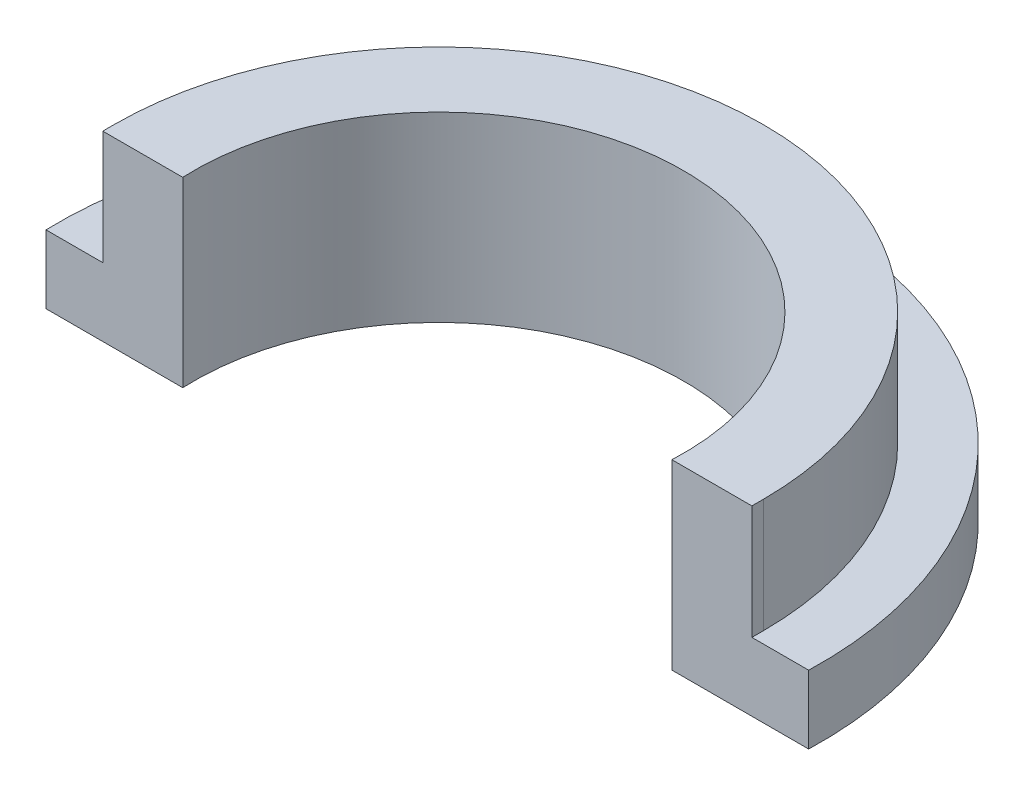
ISO-10303-21;
HEADER;
FILE_DESCRIPTION(('STEP AP214'),'2;1');
FILE_NAME('part.step','',(''),(''),'','','');
FILE_SCHEMA(('AUTOMOTIVE_DESIGN { 1 0 10303 214 1 1 1 1 }'));
ENDSEC;
DATA;
#1=APPLICATION_CONTEXT('core data for automotive mechanical design processes');
#2=APPLICATION_PROTOCOL_DEFINITION('international standard','automotive_design',2000,#1);
#3=PRODUCT_CONTEXT('',#1,'mechanical');
#4=PRODUCT('Part','Part','',(#3));
#5=PRODUCT_RELATED_PRODUCT_CATEGORY('part','',(#4));
#6=PRODUCT_DEFINITION_FORMATION('','',#4);
#7=PRODUCT_DEFINITION_CONTEXT('part definition',#1,'design');
#8=PRODUCT_DEFINITION('design','',#6,#7);
#9=PRODUCT_DEFINITION_SHAPE('','',#8);
#10=(LENGTH_UNIT() NAMED_UNIT(*) SI_UNIT(.MILLI.,.METRE.));
#11=(NAMED_UNIT(*) PLANE_ANGLE_UNIT() SI_UNIT($,.RADIAN.));
#12=(NAMED_UNIT(*) SI_UNIT($,.STERADIAN.) SOLID_ANGLE_UNIT());
#13=UNCERTAINTY_MEASURE_WITH_UNIT(LENGTH_MEASURE(1.E-05),#10,'distance_accuracy_value','');
#14=(GEOMETRIC_REPRESENTATION_CONTEXT(3) GLOBAL_UNCERTAINTY_ASSIGNED_CONTEXT((#13)) GLOBAL_UNIT_ASSIGNED_CONTEXT((#10,
#11,#12)) REPRESENTATION_CONTEXT('',''));
#15=CARTESIAN_POINT('',(0.,0.,0.));
#16=DIRECTION('',(0.,0.,1.));
#17=DIRECTION('',(1.,0.,0.));
#18=AXIS2_PLACEMENT_3D('',#15,#16,#17);
#19=CARTESIAN_POINT('',(0.,0.,0.));
#20=DIRECTION('',(0.,1.,0.));
#21=DIRECTION('',(0.,0.,1.));
#22=AXIS2_PLACEMENT_3D('',#19,#20,#21);
#23=PLANE('',#22);
#24=CARTESIAN_POINT('',(0.,0.,0.));
#25=DIRECTION('',(0.,1.,0.));
#26=DIRECTION('',(0.,0.,1.));
#27=AXIS2_PLACEMENT_3D('',#24,#25,#26);
#28=CIRCLE('',#27,13.4);
#29=CARTESIAN_POINT('',(13.3940285202026,0.,0.399999999999999));
#30=VERTEX_POINT('',#29);
#31=CARTESIAN_POINT('',(-13.3940285202026,0.,0.4));
#32=VERTEX_POINT('',#31);
#33=EDGE_CURVE('E276',#30,#32,#28,.T.);
#34=ORIENTED_EDGE('',*,*,#33,.F.);
#35=DIRECTION('',(1.,0.,0.));
#36=VECTOR('',#35,1.);
#37=CARTESIAN_POINT('',(8.59069263796581,0.,0.4));
#38=LINE('',#37,#36);
#39=CARTESIAN_POINT('',(8.59069263796581,0.,0.399999999999999));
#40=VERTEX_POINT('',#39);
#41=EDGE_CURVE('E286',#40,#30,#38,.T.);
#42=ORIENTED_EDGE('',*,*,#41,.F.);
#43=CARTESIAN_POINT('',(0.,0.,0.));
#44=DIRECTION('',(0.,-1.,0.));
#45=DIRECTION('',(0.,0.,1.));
#46=AXIS2_PLACEMENT_3D('',#43,#44,#45);
#47=CIRCLE('',#46,8.6);
#48=CARTESIAN_POINT('',(-8.59069263796581,0.,0.4));
#49=VERTEX_POINT('',#48);
#50=EDGE_CURVE('E283',#49,#40,#47,.T.);
#51=ORIENTED_EDGE('',*,*,#50,.F.);
#52=DIRECTION('',(1.,0.,0.));
#53=VECTOR('',#52,1.);
#54=CARTESIAN_POINT('',(-13.3940285202026,0.,0.4));
#55=LINE('',#54,#53);
#56=EDGE_CURVE('E280',#32,#49,#55,.T.);
#57=ORIENTED_EDGE('',*,*,#56,.F.);
#58=EDGE_LOOP('',(#34,#42,#51,#57));
#59=FACE_BOUND('',#58,.T.);
#60=CARTESIAN_POINT('',(0.,0.,0.));
#61=DIRECTION('',(0.,-1.,0.));
#62=DIRECTION('',(0.,0.,1.));
#63=AXIS2_PLACEMENT_3D('',#60,#61,#62);
#64=CIRCLE('',#63,9.);
#65=CARTESIAN_POINT('',(-9.,0.,0.));
#66=VERTEX_POINT('',#65);
#67=CARTESIAN_POINT('',(9.,0.,0.));
#68=VERTEX_POINT('',#67);
#69=EDGE_CURVE('E237',#66,#68,#64,.T.);
#70=ORIENTED_EDGE('',*,*,#69,.T.);
#71=DIRECTION('',(1.,0.,0.));
#72=VECTOR('',#71,1.);
#73=CARTESIAN_POINT('',(9.,0.,0.));
#74=LINE('',#73,#72);
#75=CARTESIAN_POINT('',(13.,0.,0.));
#76=VERTEX_POINT('',#75);
#77=EDGE_CURVE('E252',#68,#76,#74,.T.);
#78=ORIENTED_EDGE('',*,*,#77,.T.);
#79=CARTESIAN_POINT('',(0.,0.,0.));
#80=DIRECTION('',(0.,1.,0.));
#81=DIRECTION('',(0.,0.,1.));
#82=AXIS2_PLACEMENT_3D('',#79,#80,#81);
#83=CIRCLE('',#82,13.);
#84=CARTESIAN_POINT('',(-13.,0.,0.));
#85=VERTEX_POINT('',#84);
#86=EDGE_CURVE('E256',#76,#85,#83,.T.);
#87=ORIENTED_EDGE('',*,*,#86,.T.);
#88=DIRECTION('',(1.,0.,0.));
#89=VECTOR('',#88,1.);
#90=CARTESIAN_POINT('',(-13.,0.,0.));
#91=LINE('',#90,#89);
#92=EDGE_CURVE('E242',#85,#66,#91,.T.);
#93=ORIENTED_EDGE('',*,*,#92,.T.);
#94=EDGE_LOOP('',(#70,#78,#87,#93));
#95=FACE_BOUND('',#94,.T.);
#96=ADVANCED_FACE('F39',(#59,#95),#23,.F.);
#97=CARTESIAN_POINT('',(0.,2.,0.));
#98=DIRECTION('',(0.,-1.,0.));
#99=DIRECTION('',(0.,0.,-1.));
#100=AXIS2_PLACEMENT_3D('',#97,#98,#99);
#101=CYLINDRICAL_SURFACE('',#100,13.4);
#102=ORIENTED_EDGE('',*,*,#33,.T.);
#103=DIRECTION('',(0.,-1.,0.));
#104=VECTOR('',#103,1.);
#105=CARTESIAN_POINT('',(-13.3940285202026,2.,0.4));
#106=LINE('',#105,#104);
#107=CARTESIAN_POINT('',(-13.3940285202026,2.4,0.399999999999993));
#108=VERTEX_POINT('',#107);
#109=EDGE_CURVE('E11',#108,#32,#106,.T.);
#110=ORIENTED_EDGE('',*,*,#109,.F.);
#111=CARTESIAN_POINT('',(0.,2.4,0.));
#112=DIRECTION('',(0.,1.,0.));
#113=DIRECTION('',(0.,0.,1.));
#114=AXIS2_PLACEMENT_3D('',#111,#112,#113);
#115=CIRCLE('',#114,13.4);
#116=CARTESIAN_POINT('',(13.3940285202026,2.4,0.399999999999999));
#117=VERTEX_POINT('',#116);
#118=EDGE_CURVE('E194',#117,#108,#115,.T.);
#119=ORIENTED_EDGE('',*,*,#118,.F.);
#120=DIRECTION('',(0.,-1.,0.));
#121=VECTOR('',#120,1.);
#122=CARTESIAN_POINT('',(13.3940285202026,2.,0.399999999999999));
#123=LINE('',#122,#121);
#124=EDGE_CURVE('E289',#117,#30,#123,.T.);
#125=ORIENTED_EDGE('',*,*,#124,.T.);
#126=EDGE_LOOP('',(#102,#110,#119,#125));
#127=FACE_BOUND('',#126,.T.);
#128=ADVANCED_FACE('F41',(#127),#101,.T.);
#129=CARTESIAN_POINT('',(-13.3940285202026,2.,0.4));
#130=DIRECTION('',(0.,0.,-1.));
#131=DIRECTION('',(-1.,0.,0.));
#132=AXIS2_PLACEMENT_3D('',#129,#130,#131);
#133=PLANE('',#132);
#134=ORIENTED_EDGE('',*,*,#56,.T.);
#135=DIRECTION('',(0.,-1.,0.));
#136=VECTOR('',#135,1.);
#137=CARTESIAN_POINT('',(-8.59069263796581,2.,0.4));
#138=LINE('',#137,#136);
#139=CARTESIAN_POINT('',(-8.59069263796581,6.4,0.400000000000001));
#140=VERTEX_POINT('',#139);
#141=EDGE_CURVE('E48',#140,#49,#138,.T.);
#142=ORIENTED_EDGE('',*,*,#141,.F.);
#143=DIRECTION('',(1.,0.,0.));
#144=VECTOR('',#143,1.);
#145=CARTESIAN_POINT('',(-11.4,6.4,0.4));
#146=LINE('',#145,#144);
#147=CARTESIAN_POINT('',(-11.4,6.4,0.4));
#148=VERTEX_POINT('',#147);
#149=EDGE_CURVE('E164',#148,#140,#146,.T.);
#150=ORIENTED_EDGE('',*,*,#149,.F.);
#151=DIRECTION('',(0.,-1.,0.));
#152=VECTOR('',#151,1.);
#153=CARTESIAN_POINT('',(-11.4,6.,0.4));
#154=LINE('',#153,#152);
#155=CARTESIAN_POINT('',(-11.4,2.4,0.4));
#156=VERTEX_POINT('',#155);
#157=EDGE_CURVE('E154',#148,#156,#154,.T.);
#158=ORIENTED_EDGE('',*,*,#157,.T.);
#159=DIRECTION('',(1.,0.,0.));
#160=VECTOR('',#159,1.);
#161=CARTESIAN_POINT('',(-13.3940285202026,2.4,0.4));
#162=LINE('',#161,#160);
#163=EDGE_CURVE('E55',#108,#156,#162,.T.);
#164=ORIENTED_EDGE('',*,*,#163,.F.);
#165=ORIENTED_EDGE('',*,*,#109,.T.);
#166=EDGE_LOOP('',(#134,#142,#150,#158,#164,#165));
#167=FACE_BOUND('',#166,.T.);
#168=ADVANCED_FACE('F314',(#167),#133,.F.);
#169=CARTESIAN_POINT('',(0.,2.,0.));
#170=DIRECTION('',(0.,-1.,0.));
#171=DIRECTION('',(0.,0.,-1.));
#172=AXIS2_PLACEMENT_3D('',#169,#170,#171);
#173=CYLINDRICAL_SURFACE('',#172,8.6);
#174=ORIENTED_EDGE('',*,*,#50,.T.);
#175=DIRECTION('',(0.,-1.,0.));
#176=VECTOR('',#175,1.);
#177=CARTESIAN_POINT('',(8.59069263796581,2.,0.399999999999999));
#178=LINE('',#177,#176);
#179=CARTESIAN_POINT('',(8.59069263796581,6.4,0.399999999999999));
#180=VERTEX_POINT('',#179);
#181=EDGE_CURVE('E293',#180,#40,#178,.T.);
#182=ORIENTED_EDGE('',*,*,#181,.F.);
#183=CARTESIAN_POINT('',(0.,6.4,0.));
#184=DIRECTION('',(0.,-1.,0.));
#185=DIRECTION('',(0.,0.,1.));
#186=AXIS2_PLACEMENT_3D('',#183,#184,#185);
#187=CIRCLE('',#186,8.6);
#188=EDGE_CURVE('E176',#140,#180,#187,.T.);
#189=ORIENTED_EDGE('',*,*,#188,.F.);
#190=ORIENTED_EDGE('',*,*,#141,.T.);
#191=EDGE_LOOP('',(#174,#182,#189,#190));
#192=FACE_BOUND('',#191,.T.);
#193=ADVANCED_FACE('F301',(#192),#173,.F.);
#194=CARTESIAN_POINT('',(8.59069263796581,2.,0.4));
#195=DIRECTION('',(0.,0.,-1.));
#196=DIRECTION('',(-1.,0.,0.));
#197=AXIS2_PLACEMENT_3D('',#194,#195,#196);
#198=PLANE('',#197);
#199=ORIENTED_EDGE('',*,*,#124,.F.);
#200=DIRECTION('',(1.,0.,0.));
#201=VECTOR('',#200,1.);
#202=CARTESIAN_POINT('',(13.3940285202026,2.4,0.399999999999999));
#203=LINE('',#202,#201);
#204=CARTESIAN_POINT('',(11.4,2.4,0.4));
#205=VERTEX_POINT('',#204);
#206=EDGE_CURVE('E190',#205,#117,#203,.T.);
#207=ORIENTED_EDGE('',*,*,#206,.F.);
#208=DIRECTION('',(0.,-1.,0.));
#209=VECTOR('',#208,1.);
#210=CARTESIAN_POINT('',(11.4,6.,0.4));
#211=LINE('',#210,#209);
#212=CARTESIAN_POINT('',(11.4,6.4,0.4));
#213=VERTEX_POINT('',#212);
#214=EDGE_CURVE('E233',#213,#205,#211,.T.);
#215=ORIENTED_EDGE('',*,*,#214,.F.);
#216=DIRECTION('',(1.,0.,0.));
#217=VECTOR('',#216,1.);
#218=CARTESIAN_POINT('',(8.59069263796581,6.4,0.399999999999999));
#219=LINE('',#218,#217);
#220=EDGE_CURVE('E180',#180,#213,#219,.T.);
#221=ORIENTED_EDGE('',*,*,#220,.F.);
#222=ORIENTED_EDGE('',*,*,#181,.T.);
#223=ORIENTED_EDGE('',*,*,#41,.T.);
#224=EDGE_LOOP('',(#199,#207,#215,#221,#222,#223));
#225=FACE_BOUND('',#224,.T.);
#226=ADVANCED_FACE('F308',(#225),#198,.F.);
#227=CARTESIAN_POINT('',(0.,2.,0.));
#228=DIRECTION('',(0.,-1.,0.));
#229=DIRECTION('',(0.,0.,-1.));
#230=AXIS2_PLACEMENT_3D('',#227,#228,#229);
#231=CYLINDRICAL_SURFACE('',#230,9.);
#232=ORIENTED_EDGE('',*,*,#69,.F.);
#233=DIRECTION('',(0.,-1.,0.));
#234=VECTOR('',#233,1.);
#235=CARTESIAN_POINT('',(-9.,2.,0.));
#236=LINE('',#235,#234);
#237=CARTESIAN_POINT('',(-9.,6.,0.));
#238=VERTEX_POINT('',#237);
#239=EDGE_CURVE('E248',#238,#66,#236,.T.);
#240=ORIENTED_EDGE('',*,*,#239,.F.);
#241=CARTESIAN_POINT('',(0.,6.,0.));
#242=DIRECTION('',(0.,-1.,0.));
#243=DIRECTION('',(0.,0.,1.));
#244=AXIS2_PLACEMENT_3D('',#241,#242,#243);
#245=CIRCLE('',#244,9.);
#246=CARTESIAN_POINT('',(9.,6.,0.));
#247=VERTEX_POINT('',#246);
#248=EDGE_CURVE('E203',#238,#247,#245,.T.);
#249=ORIENTED_EDGE('',*,*,#248,.T.);
#250=DIRECTION('',(0.,-1.,0.));
#251=VECTOR('',#250,1.);
#252=CARTESIAN_POINT('',(9.,2.,0.));
#253=LINE('',#252,#251);
#254=EDGE_CURVE('E272',#247,#68,#253,.T.);
#255=ORIENTED_EDGE('',*,*,#254,.T.);
#256=EDGE_LOOP('',(#232,#240,#249,#255));
#257=FACE_BOUND('',#256,.T.);
#258=ADVANCED_FACE('F337',(#257),#231,.T.);
#259=CARTESIAN_POINT('',(9.,2.,0.));
#260=DIRECTION('',(0.,0.,-1.));
#261=DIRECTION('',(-1.,0.,0.));
#262=AXIS2_PLACEMENT_3D('',#259,#260,#261);
#263=PLANE('',#262);
#264=ORIENTED_EDGE('',*,*,#77,.F.);
#265=ORIENTED_EDGE('',*,*,#254,.F.);
#266=DIRECTION('',(1.,0.,0.));
#267=VECTOR('',#266,1.);
#268=CARTESIAN_POINT('',(9.,6.,0.));
#269=LINE('',#268,#267);
#270=CARTESIAN_POINT('',(11.,6.,0.));
#271=VERTEX_POINT('',#270);
#272=EDGE_CURVE('E207',#247,#271,#269,.T.);
#273=ORIENTED_EDGE('',*,*,#272,.T.);
#274=DIRECTION('',(0.,-1.,0.));
#275=VECTOR('',#274,1.);
#276=CARTESIAN_POINT('',(11.,6.,0.));
#277=LINE('',#276,#275);
#278=CARTESIAN_POINT('',(11.,2.,0.));
#279=VERTEX_POINT('',#278);
#280=EDGE_CURVE('E225',#271,#279,#277,.T.);
#281=ORIENTED_EDGE('',*,*,#280,.T.);
#282=DIRECTION('',(1.,0.,0.));
#283=VECTOR('',#282,1.);
#284=CARTESIAN_POINT('',(9.,2.,0.));
#285=LINE('',#284,#283);
#286=CARTESIAN_POINT('',(13.,2.,0.));
#287=VERTEX_POINT('',#286);
#288=EDGE_CURVE('E238',#279,#287,#285,.T.);
#289=ORIENTED_EDGE('',*,*,#288,.T.);
#290=DIRECTION('',(0.,-1.,0.));
#291=VECTOR('',#290,1.);
#292=CARTESIAN_POINT('',(13.,2.,0.));
#293=LINE('',#292,#291);
#294=EDGE_CURVE('E269',#287,#76,#293,.T.);
#295=ORIENTED_EDGE('',*,*,#294,.T.);
#296=EDGE_LOOP('',(#264,#265,#273,#281,#289,#295));
#297=FACE_BOUND('',#296,.T.);
#298=ADVANCED_FACE('F362',(#297),#263,.T.);
#299=CARTESIAN_POINT('',(0.,2.,0.));
#300=DIRECTION('',(0.,-1.,0.));
#301=DIRECTION('',(0.,0.,-1.));
#302=AXIS2_PLACEMENT_3D('',#299,#300,#301);
#303=CYLINDRICAL_SURFACE('',#302,13.);
#304=ORIENTED_EDGE('',*,*,#86,.F.);
#305=ORIENTED_EDGE('',*,*,#294,.F.);
#306=CARTESIAN_POINT('',(0.,2.,0.));
#307=DIRECTION('',(0.,1.,0.));
#308=DIRECTION('',(0.,0.,1.));
#309=AXIS2_PLACEMENT_3D('',#306,#307,#308);
#310=CIRCLE('',#309,13.);
#311=CARTESIAN_POINT('',(-13.,2.,0.));
#312=VERTEX_POINT('',#311);
#313=EDGE_CURVE('E241',#287,#312,#310,.T.);
#314=ORIENTED_EDGE('',*,*,#313,.T.);
#315=DIRECTION('',(0.,-1.,0.));
#316=VECTOR('',#315,1.);
#317=CARTESIAN_POINT('',(-13.,2.,0.));
#318=LINE('',#317,#316);
#319=EDGE_CURVE('E266',#312,#85,#318,.T.);
#320=ORIENTED_EDGE('',*,*,#319,.T.);
#321=EDGE_LOOP('',(#304,#305,#314,#320));
#322=FACE_BOUND('',#321,.T.);
#323=ADVANCED_FACE('F369',(#322),#303,.F.);
#324=CARTESIAN_POINT('',(-13.,2.,0.));
#325=DIRECTION('',(0.,0.,-1.));
#326=DIRECTION('',(-1.,0.,0.));
#327=AXIS2_PLACEMENT_3D('',#324,#325,#326);
#328=PLANE('',#327);
#329=ORIENTED_EDGE('',*,*,#92,.F.);
#330=ORIENTED_EDGE('',*,*,#319,.F.);
#331=DIRECTION('',(1.,0.,0.));
#332=VECTOR('',#331,1.);
#333=CARTESIAN_POINT('',(-13.,2.,0.));
#334=LINE('',#333,#332);
#335=CARTESIAN_POINT('',(-11.,2.,0.));
#336=VERTEX_POINT('',#335);
#337=EDGE_CURVE('E63',#312,#336,#334,.T.);
#338=ORIENTED_EDGE('',*,*,#337,.T.);
#339=DIRECTION('',(0.,-1.,0.));
#340=VECTOR('',#339,1.);
#341=CARTESIAN_POINT('',(-11.,6.,0.));
#342=LINE('',#341,#340);
#343=CARTESIAN_POINT('',(-11.,6.,0.));
#344=VERTEX_POINT('',#343);
#345=EDGE_CURVE('E219',#344,#336,#342,.T.);
#346=ORIENTED_EDGE('',*,*,#345,.F.);
#347=DIRECTION('',(1.,0.,0.));
#348=VECTOR('',#347,1.);
#349=CARTESIAN_POINT('',(-11.,6.,0.));
#350=LINE('',#349,#348);
#351=EDGE_CURVE('E215',#344,#238,#350,.T.);
#352=ORIENTED_EDGE('',*,*,#351,.T.);
#353=ORIENTED_EDGE('',*,*,#239,.T.);
#354=EDGE_LOOP('',(#329,#330,#338,#346,#352,#353));
#355=FACE_BOUND('',#354,.T.);
#356=ADVANCED_FACE('F326',(#355),#328,.T.);
#357=CARTESIAN_POINT('',(0.,2.,0.));
#358=DIRECTION('',(0.,1.,0.));
#359=DIRECTION('',(0.,0.,1.));
#360=AXIS2_PLACEMENT_3D('',#357,#358,#359);
#361=PLANE('',#360);
#362=ORIENTED_EDGE('',*,*,#288,.F.);
#363=CARTESIAN_POINT('',(0.,2.,0.));
#364=DIRECTION('',(0.,1.,0.));
#365=DIRECTION('',(0.,0.,1.));
#366=AXIS2_PLACEMENT_3D('',#363,#364,#365);
#367=CIRCLE('',#366,11.);
#368=EDGE_CURVE('E202',#279,#336,#367,.T.);
#369=ORIENTED_EDGE('',*,*,#368,.T.);
#370=ORIENTED_EDGE('',*,*,#337,.F.);
#371=ORIENTED_EDGE('',*,*,#313,.F.);
#372=EDGE_LOOP('',(#362,#369,#370,#371));
#373=FACE_BOUND('',#372,.T.);
#374=ADVANCED_FACE('F319',(#373),#361,.F.);
#375=CARTESIAN_POINT('',(11.4,6.,0.4));
#376=DIRECTION('',(-1.,0.,0.));
#377=DIRECTION('',(0.,0.,1.));
#378=AXIS2_PLACEMENT_3D('',#375,#376,#377);
#379=PLANE('',#378);
#380=ORIENTED_EDGE('',*,*,#214,.T.);
#381=DIRECTION('',(0.,0.,1.));
#382=VECTOR('',#381,1.);
#383=CARTESIAN_POINT('',(11.4,2.4,0.4));
#384=LINE('',#383,#382);
#385=CARTESIAN_POINT('',(11.4,2.4,0.));
#386=VERTEX_POINT('',#385);
#387=EDGE_CURVE('E187',#386,#205,#384,.T.);
#388=ORIENTED_EDGE('',*,*,#387,.F.);
#389=DIRECTION('',(0.,-1.,0.));
#390=VECTOR('',#389,1.);
#391=CARTESIAN_POINT('',(11.4,6.,0.));
#392=LINE('',#391,#390);
#393=CARTESIAN_POINT('',(11.4,6.4,0.));
#394=VERTEX_POINT('',#393);
#395=EDGE_CURVE('E153',#394,#386,#392,.T.);
#396=ORIENTED_EDGE('',*,*,#395,.F.);
#397=DIRECTION('',(0.,0.,-1.));
#398=VECTOR('',#397,1.);
#399=CARTESIAN_POINT('',(11.4,6.4,0.));
#400=LINE('',#399,#398);
#401=EDGE_CURVE('E170',#213,#394,#400,.T.);
#402=ORIENTED_EDGE('',*,*,#401,.F.);
#403=EDGE_LOOP('',(#380,#388,#396,#402));
#404=FACE_BOUND('',#403,.T.);
#405=ADVANCED_FACE('F317',(#404),#379,.F.);
#406=CARTESIAN_POINT('',(0.,6.,0.));
#407=DIRECTION('',(0.,-1.,0.));
#408=DIRECTION('',(0.,0.,-1.));
#409=AXIS2_PLACEMENT_3D('',#406,#407,#408);
#410=CYLINDRICAL_SURFACE('',#409,11.4);
#411=ORIENTED_EDGE('',*,*,#395,.T.);
#412=CARTESIAN_POINT('',(0.,2.4,0.));
#413=DIRECTION('',(0.,-1.,0.));
#414=DIRECTION('',(0.,0.,1.));
#415=AXIS2_PLACEMENT_3D('',#412,#413,#414);
#416=CIRCLE('',#415,11.4);
#417=CARTESIAN_POINT('',(-11.4,2.4,0.));
#418=VERTEX_POINT('',#417);
#419=EDGE_CURVE('E150',#418,#386,#416,.T.);
#420=ORIENTED_EDGE('',*,*,#419,.F.);
#421=DIRECTION('',(0.,-1.,0.));
#422=VECTOR('',#421,1.);
#423=CARTESIAN_POINT('',(-11.4,6.,0.));
#424=LINE('',#423,#422);
#425=CARTESIAN_POINT('',(-11.4,6.4,0.));
#426=VERTEX_POINT('',#425);
#427=EDGE_CURVE('E144',#426,#418,#424,.T.);
#428=ORIENTED_EDGE('',*,*,#427,.F.);
#429=CARTESIAN_POINT('',(0.,6.4,0.));
#430=DIRECTION('',(0.,1.,0.));
#431=DIRECTION('',(0.,0.,1.));
#432=AXIS2_PLACEMENT_3D('',#429,#430,#431);
#433=CIRCLE('',#432,11.4);
#434=EDGE_CURVE('E149',#394,#426,#433,.T.);
#435=ORIENTED_EDGE('',*,*,#434,.F.);
#436=EDGE_LOOP('',(#411,#420,#428,#435));
#437=FACE_BOUND('',#436,.T.);
#438=ADVANCED_FACE('F147',(#437),#410,.T.);
#439=CARTESIAN_POINT('',(-11.4,6.,0.));
#440=DIRECTION('',(1.,0.,0.));
#441=DIRECTION('',(0.,0.,-1.));
#442=AXIS2_PLACEMENT_3D('',#439,#440,#441);
#443=PLANE('',#442);
#444=ORIENTED_EDGE('',*,*,#427,.T.);
#445=DIRECTION('',(0.,0.,-1.));
#446=VECTOR('',#445,1.);
#447=CARTESIAN_POINT('',(-11.4,2.4,0.4));
#448=LINE('',#447,#446);
#449=EDGE_CURVE('E199',#156,#418,#448,.T.);
#450=ORIENTED_EDGE('',*,*,#449,.F.);
#451=ORIENTED_EDGE('',*,*,#157,.F.);
#452=DIRECTION('',(0.,0.,1.));
#453=VECTOR('',#452,1.);
#454=CARTESIAN_POINT('',(-11.4,6.4,0.4));
#455=LINE('',#454,#453);
#456=EDGE_CURVE('E157',#426,#148,#455,.T.);
#457=ORIENTED_EDGE('',*,*,#456,.F.);
#458=EDGE_LOOP('',(#444,#450,#451,#457));
#459=FACE_BOUND('',#458,.T.);
#460=ADVANCED_FACE('F158',(#459),#443,.F.);
#461=CARTESIAN_POINT('',(0.,6.,0.));
#462=DIRECTION('',(0.,-1.,0.));
#463=DIRECTION('',(0.,0.,-1.));
#464=AXIS2_PLACEMENT_3D('',#461,#462,#463);
#465=CYLINDRICAL_SURFACE('',#464,11.);
#466=ORIENTED_EDGE('',*,*,#368,.F.);
#467=ORIENTED_EDGE('',*,*,#280,.F.);
#468=CARTESIAN_POINT('',(0.,6.,0.));
#469=DIRECTION('',(0.,1.,0.));
#470=DIRECTION('',(0.,0.,1.));
#471=AXIS2_PLACEMENT_3D('',#468,#469,#470);
#472=CIRCLE('',#471,11.);
#473=EDGE_CURVE('E211',#271,#344,#472,.T.);
#474=ORIENTED_EDGE('',*,*,#473,.T.);
#475=ORIENTED_EDGE('',*,*,#345,.T.);
#476=EDGE_LOOP('',(#466,#467,#474,#475));
#477=FACE_BOUND('',#476,.T.);
#478=ADVANCED_FACE('F396',(#477),#465,.F.);
#479=CARTESIAN_POINT('',(0.,2.4,0.));
#480=DIRECTION('',(0.,1.,0.));
#481=DIRECTION('',(0.,0.,1.));
#482=AXIS2_PLACEMENT_3D('',#479,#480,#481);
#483=PLANE('',#482);
#484=ORIENTED_EDGE('',*,*,#419,.T.);
#485=ORIENTED_EDGE('',*,*,#387,.T.);
#486=ORIENTED_EDGE('',*,*,#206,.T.);
#487=ORIENTED_EDGE('',*,*,#118,.T.);
#488=ORIENTED_EDGE('',*,*,#163,.T.);
#489=ORIENTED_EDGE('',*,*,#449,.T.);
#490=EDGE_LOOP('',(#484,#485,#486,#487,#488,#489));
#491=FACE_BOUND('',#490,.T.);
#492=ADVANCED_FACE('F313',(#491),#483,.T.);
#493=CARTESIAN_POINT('',(0.,6.,0.));
#494=DIRECTION('',(0.,1.,0.));
#495=DIRECTION('',(0.,0.,1.));
#496=AXIS2_PLACEMENT_3D('',#493,#494,#495);
#497=PLANE('',#496);
#498=ORIENTED_EDGE('',*,*,#272,.F.);
#499=ORIENTED_EDGE('',*,*,#248,.F.);
#500=ORIENTED_EDGE('',*,*,#351,.F.);
#501=ORIENTED_EDGE('',*,*,#473,.F.);
#502=EDGE_LOOP('',(#498,#499,#500,#501));
#503=FACE_BOUND('',#502,.T.);
#504=ADVANCED_FACE('F395',(#503),#497,.F.);
#505=CARTESIAN_POINT('',(0.,6.4,0.));
#506=DIRECTION('',(0.,1.,0.));
#507=DIRECTION('',(0.,0.,1.));
#508=AXIS2_PLACEMENT_3D('',#505,#506,#507);
#509=PLANE('',#508);
#510=ORIENTED_EDGE('',*,*,#434,.T.);
#511=ORIENTED_EDGE('',*,*,#456,.T.);
#512=ORIENTED_EDGE('',*,*,#149,.T.);
#513=ORIENTED_EDGE('',*,*,#188,.T.);
#514=ORIENTED_EDGE('',*,*,#220,.T.);
#515=ORIENTED_EDGE('',*,*,#401,.T.);
#516=EDGE_LOOP('',(#510,#511,#512,#513,#514,#515));
#517=FACE_BOUND('',#516,.T.);
#518=ADVANCED_FACE('F167',(#517),#509,.T.);
#519=CLOSED_SHELL('',(#96,#128,#168,#193,#226,#258,#298,#323,#356,#374,#405,#438,#460,#478,#492,
#504,#518));
#520=MANIFOLD_SOLID_BREP('B2',#519);
#521=ADVANCED_BREP_SHAPE_REPRESENTATION('',(#18,#520),#14);
#522=SHAPE_DEFINITION_REPRESENTATION(#9,#521);
ENDSEC;
END-ISO-10303-21;
